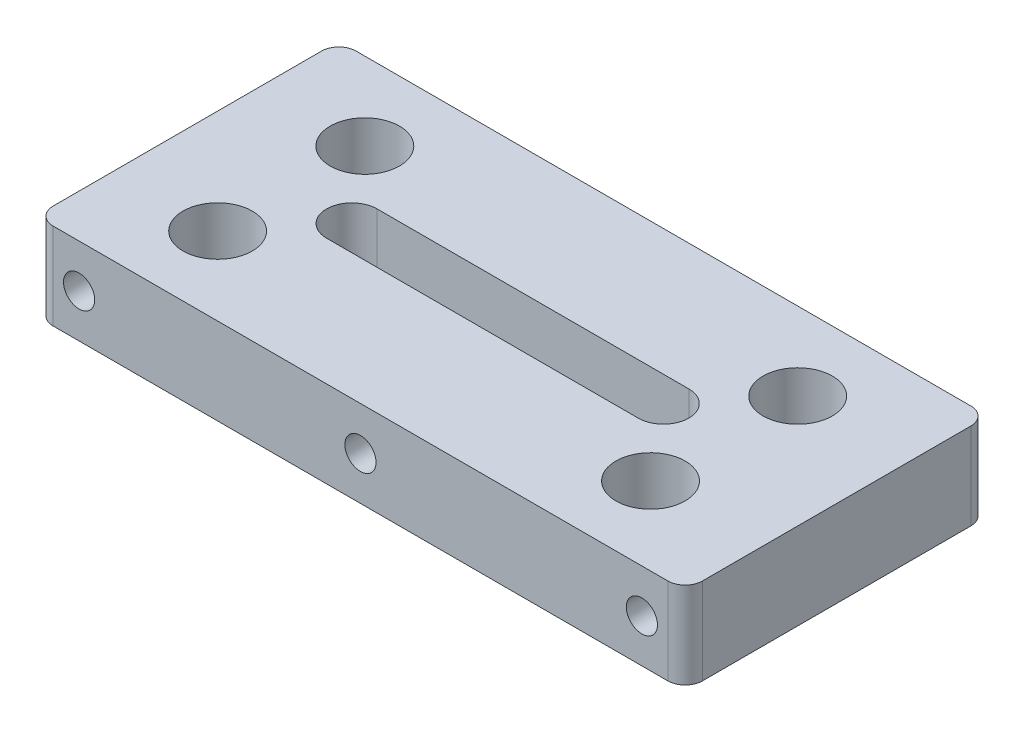
ISO-10303-21;
HEADER;
FILE_DESCRIPTION(('STEP AP214'),'2;1');
FILE_NAME('part.step','',(''),(''),'','','');
FILE_SCHEMA(('AUTOMOTIVE_DESIGN { 1 0 10303 214 1 1 1 1 }'));
ENDSEC;
DATA;
#1=APPLICATION_CONTEXT('core data for automotive mechanical design processes');
#2=APPLICATION_PROTOCOL_DEFINITION('international standard','automotive_design',2000,#1);
#3=PRODUCT_CONTEXT('',#1,'mechanical');
#4=PRODUCT('Part','Part','',(#3));
#5=PRODUCT_RELATED_PRODUCT_CATEGORY('part','',(#4));
#6=PRODUCT_DEFINITION_FORMATION('','',#4);
#7=PRODUCT_DEFINITION_CONTEXT('part definition',#1,'design');
#8=PRODUCT_DEFINITION('design','',#6,#7);
#9=PRODUCT_DEFINITION_SHAPE('','',#8);
#10=(LENGTH_UNIT() NAMED_UNIT(*) SI_UNIT(.MILLI.,.METRE.));
#11=(NAMED_UNIT(*) PLANE_ANGLE_UNIT() SI_UNIT($,.RADIAN.));
#12=(NAMED_UNIT(*) SI_UNIT($,.STERADIAN.) SOLID_ANGLE_UNIT());
#13=UNCERTAINTY_MEASURE_WITH_UNIT(LENGTH_MEASURE(1.E-05),#10,'distance_accuracy_value','');
#14=(GEOMETRIC_REPRESENTATION_CONTEXT(3) GLOBAL_UNCERTAINTY_ASSIGNED_CONTEXT((#13)) GLOBAL_UNIT_ASSIGNED_CONTEXT((#10,
#11,#12)) REPRESENTATION_CONTEXT('',''));
#15=CARTESIAN_POINT('',(0.,0.,0.));
#16=DIRECTION('',(0.,0.,1.));
#17=DIRECTION('',(1.,0.,0.));
#18=AXIS2_PLACEMENT_3D('',#15,#16,#17);
#19=CARTESIAN_POINT('',(0.,10.,0.));
#20=DIRECTION('',(1.,0.,0.));
#21=DIRECTION('',(0.,0.,-1.));
#22=AXIS2_PLACEMENT_3D('',#19,#20,#21);
#23=PLANE('',#22);
#24=DIRECTION('',(0.,0.,1.));
#25=VECTOR('',#24,1.);
#26=CARTESIAN_POINT('',(0.,10.,0.));
#27=LINE('',#26,#25);
#28=CARTESIAN_POINT('',(0.,10.,-33.));
#29=VERTEX_POINT('',#28);
#30=CARTESIAN_POINT('',(0.,10.,-2.));
#31=VERTEX_POINT('',#30);
#32=EDGE_CURVE('E248',#29,#31,#27,.T.);
#33=ORIENTED_EDGE('',*,*,#32,.F.);
#34=DIRECTION('',(0.,-1.,0.));
#35=VECTOR('',#34,1.);
#36=CARTESIAN_POINT('',(0.,10.,-33.));
#37=LINE('',#36,#35);
#38=CARTESIAN_POINT('',(0.,0.,-33.));
#39=VERTEX_POINT('',#38);
#40=EDGE_CURVE('E279',#29,#39,#37,.T.);
#41=ORIENTED_EDGE('',*,*,#40,.T.);
#42=DIRECTION('',(0.,0.,1.));
#43=VECTOR('',#42,1.);
#44=CARTESIAN_POINT('',(0.,0.,0.));
#45=LINE('',#44,#43);
#46=CARTESIAN_POINT('',(0.,0.,-2.));
#47=VERTEX_POINT('',#46);
#48=EDGE_CURVE('E228',#39,#47,#45,.T.);
#49=ORIENTED_EDGE('',*,*,#48,.T.);
#50=DIRECTION('',(0.,-1.,0.));
#51=VECTOR('',#50,1.);
#52=CARTESIAN_POINT('',(0.,10.,-2.));
#53=LINE('',#52,#51);
#54=EDGE_CURVE('E263',#47,#31,#53,.F.);
#55=ORIENTED_EDGE('',*,*,#54,.T.);
#56=EDGE_LOOP('',(#33,#41,#49,#55));
#57=FACE_BOUND('',#56,.T.);
#58=ADVANCED_FACE('F41',(#57),#23,.F.);
#59=CARTESIAN_POINT('',(0.,10.,0.));
#60=DIRECTION('',(0.,0.,-1.));
#61=DIRECTION('',(-1.,0.,0.));
#62=AXIS2_PLACEMENT_3D('',#59,#60,#61);
#63=PLANE('',#62);
#64=CARTESIAN_POINT('',(5.,5.,0.));
#65=DIRECTION('',(0.,0.,1.));
#66=DIRECTION('',(1.,0.,0.));
#67=AXIS2_PLACEMENT_3D('',#64,#65,#66);
#68=CIRCLE('',#67,1.8);
#69=CARTESIAN_POINT('',(6.8,5.,0.));
#70=VERTEX_POINT('',#69);
#71=EDGE_CURVE('E229',#70,#70,#68,.T.);
#72=ORIENTED_EDGE('',*,*,#71,.F.);
#73=EDGE_LOOP('',(#72));
#74=FACE_BOUND('',#73,.T.);
#75=CARTESIAN_POINT('',(37.5,5.,0.));
#76=DIRECTION('',(0.,0.,1.));
#77=DIRECTION('',(1.,0.,0.));
#78=AXIS2_PLACEMENT_3D('',#75,#76,#77);
#79=CIRCLE('',#78,1.8);
#80=CARTESIAN_POINT('',(39.3,5.,0.));
#81=VERTEX_POINT('',#80);
#82=EDGE_CURVE('E237',#81,#81,#79,.T.);
#83=ORIENTED_EDGE('',*,*,#82,.F.);
#84=EDGE_LOOP('',(#83));
#85=FACE_BOUND('',#84,.T.);
#86=CARTESIAN_POINT('',(70.,5.,0.));
#87=DIRECTION('',(0.,0.,1.));
#88=DIRECTION('',(1.,0.,0.));
#89=AXIS2_PLACEMENT_3D('',#86,#87,#88);
#90=CIRCLE('',#89,1.79999999999999);
#91=CARTESIAN_POINT('',(71.8,5.,0.));
#92=VERTEX_POINT('',#91);
#93=EDGE_CURVE('E204',#92,#92,#90,.T.);
#94=ORIENTED_EDGE('',*,*,#93,.F.);
#95=EDGE_LOOP('',(#94));
#96=FACE_BOUND('',#95,.T.);
#97=DIRECTION('',(1.,0.,0.));
#98=VECTOR('',#97,1.);
#99=CARTESIAN_POINT('',(0.,10.,0.));
#100=LINE('',#99,#98);
#101=CARTESIAN_POINT('',(2.,10.,0.));
#102=VERTEX_POINT('',#101);
#103=CARTESIAN_POINT('',(73.,10.,0.));
#104=VERTEX_POINT('',#103);
#105=EDGE_CURVE('E252',#102,#104,#100,.T.);
#106=ORIENTED_EDGE('',*,*,#105,.F.);
#107=DIRECTION('',(0.,-1.,0.));
#108=VECTOR('',#107,1.);
#109=CARTESIAN_POINT('',(2.,10.,0.));
#110=LINE('',#109,#108);
#111=CARTESIAN_POINT('',(2.,0.,0.));
#112=VERTEX_POINT('',#111);
#113=EDGE_CURVE('E316',#102,#112,#110,.T.);
#114=ORIENTED_EDGE('',*,*,#113,.T.);
#115=DIRECTION('',(1.,0.,0.));
#116=VECTOR('',#115,1.);
#117=CARTESIAN_POINT('',(0.,0.,0.));
#118=LINE('',#117,#116);
#119=CARTESIAN_POINT('',(73.,0.,0.));
#120=VERTEX_POINT('',#119);
#121=EDGE_CURVE('E267',#112,#120,#118,.T.);
#122=ORIENTED_EDGE('',*,*,#121,.T.);
#123=DIRECTION('',(0.,-1.,0.));
#124=VECTOR('',#123,1.);
#125=CARTESIAN_POINT('',(73.,10.,0.));
#126=LINE('',#125,#124);
#127=EDGE_CURVE('E313',#120,#104,#126,.F.);
#128=ORIENTED_EDGE('',*,*,#127,.T.);
#129=EDGE_LOOP('',(#106,#114,#122,#128));
#130=FACE_BOUND('',#129,.T.);
#131=ADVANCED_FACE('F369',(#74,#85,#96,#130),#63,.F.);
#132=CARTESIAN_POINT('',(75.,10.,0.));
#133=DIRECTION('',(-1.,0.,0.));
#134=DIRECTION('',(0.,0.,1.));
#135=AXIS2_PLACEMENT_3D('',#132,#133,#134);
#136=PLANE('',#135);
#137=DIRECTION('',(0.,0.,-1.));
#138=VECTOR('',#137,1.);
#139=CARTESIAN_POINT('',(75.,10.,0.));
#140=LINE('',#139,#138);
#141=CARTESIAN_POINT('',(75.,10.,-2.));
#142=VERTEX_POINT('',#141);
#143=CARTESIAN_POINT('',(75.,10.,-33.));
#144=VERTEX_POINT('',#143);
#145=EDGE_CURVE('E256',#142,#144,#140,.T.);
#146=ORIENTED_EDGE('',*,*,#145,.F.);
#147=DIRECTION('',(0.,-1.,0.));
#148=VECTOR('',#147,1.);
#149=CARTESIAN_POINT('',(75.,10.,-2.));
#150=LINE('',#149,#148);
#151=CARTESIAN_POINT('',(75.,0.,-2.));
#152=VERTEX_POINT('',#151);
#153=EDGE_CURVE('E11',#142,#152,#150,.T.);
#154=ORIENTED_EDGE('',*,*,#153,.T.);
#155=DIRECTION('',(0.,0.,-1.));
#156=VECTOR('',#155,1.);
#157=CARTESIAN_POINT('',(75.,0.,0.));
#158=LINE('',#157,#156);
#159=CARTESIAN_POINT('',(75.,0.,-33.));
#160=VERTEX_POINT('',#159);
#161=EDGE_CURVE('E271',#152,#160,#158,.T.);
#162=ORIENTED_EDGE('',*,*,#161,.T.);
#163=DIRECTION('',(0.,-1.,0.));
#164=VECTOR('',#163,1.);
#165=CARTESIAN_POINT('',(75.,10.,-33.));
#166=LINE('',#165,#164);
#167=EDGE_CURVE('E50',#160,#144,#166,.F.);
#168=ORIENTED_EDGE('',*,*,#167,.T.);
#169=EDGE_LOOP('',(#146,#154,#162,#168));
#170=FACE_BOUND('',#169,.T.);
#171=ADVANCED_FACE('F375',(#170),#136,.F.);
#172=CARTESIAN_POINT('',(0.,10.,-35.));
#173=DIRECTION('',(0.,0.,1.));
#174=DIRECTION('',(1.,0.,0.));
#175=AXIS2_PLACEMENT_3D('',#172,#173,#174);
#176=PLANE('',#175);
#177=CARTESIAN_POINT('',(5.,5.,-35.));
#178=DIRECTION('',(0.,0.,-1.));
#179=DIRECTION('',(-1.,0.,0.));
#180=AXIS2_PLACEMENT_3D('',#177,#178,#179);
#181=CIRCLE('',#180,1.8);
#182=CARTESIAN_POINT('',(3.2,5.,-35.));
#183=VERTEX_POINT('',#182);
#184=EDGE_CURVE('E205',#183,#183,#181,.T.);
#185=ORIENTED_EDGE('',*,*,#184,.F.);
#186=EDGE_LOOP('',(#185));
#187=FACE_BOUND('',#186,.T.);
#188=CARTESIAN_POINT('',(37.5,4.99999999999977,-35.));
#189=DIRECTION('',(0.,0.,-1.));
#190=DIRECTION('',(-1.,0.,0.));
#191=AXIS2_PLACEMENT_3D('',#188,#189,#190);
#192=CIRCLE('',#191,1.8);
#193=CARTESIAN_POINT('',(35.7,4.99999999999977,-35.));
#194=VERTEX_POINT('',#193);
#195=EDGE_CURVE('E213',#194,#194,#192,.T.);
#196=ORIENTED_EDGE('',*,*,#195,.F.);
#197=EDGE_LOOP('',(#196));
#198=FACE_BOUND('',#197,.T.);
#199=CARTESIAN_POINT('',(70.,4.99999999999955,-35.));
#200=DIRECTION('',(0.,0.,-1.));
#201=DIRECTION('',(-1.,0.,0.));
#202=AXIS2_PLACEMENT_3D('',#199,#200,#201);
#203=CIRCLE('',#202,1.79999999999999);
#204=CARTESIAN_POINT('',(68.2,4.99999999999955,-35.));
#205=VERTEX_POINT('',#204);
#206=EDGE_CURVE('E194',#205,#205,#203,.T.);
#207=ORIENTED_EDGE('',*,*,#206,.F.);
#208=EDGE_LOOP('',(#207));
#209=FACE_BOUND('',#208,.T.);
#210=DIRECTION('',(-1.,0.,0.));
#211=VECTOR('',#210,1.);
#212=CARTESIAN_POINT('',(0.,0.,-35.));
#213=LINE('',#212,#211);
#214=CARTESIAN_POINT('',(73.,0.,-35.));
#215=VERTEX_POINT('',#214);
#216=CARTESIAN_POINT('',(2.,0.,-35.));
#217=VERTEX_POINT('',#216);
#218=EDGE_CURVE('E253',#215,#217,#213,.T.);
#219=ORIENTED_EDGE('',*,*,#218,.T.);
#220=DIRECTION('',(0.,-1.,0.));
#221=VECTOR('',#220,1.);
#222=CARTESIAN_POINT('',(2.,10.,-35.));
#223=LINE('',#222,#221);
#224=CARTESIAN_POINT('',(2.,10.,-35.));
#225=VERTEX_POINT('',#224);
#226=EDGE_CURVE('E299',#217,#225,#223,.F.);
#227=ORIENTED_EDGE('',*,*,#226,.T.);
#228=DIRECTION('',(-1.,0.,0.));
#229=VECTOR('',#228,1.);
#230=CARTESIAN_POINT('',(0.,10.,-35.));
#231=LINE('',#230,#229);
#232=CARTESIAN_POINT('',(73.,10.,-35.));
#233=VERTEX_POINT('',#232);
#234=EDGE_CURVE('E259',#233,#225,#231,.T.);
#235=ORIENTED_EDGE('',*,*,#234,.F.);
#236=DIRECTION('',(0.,-1.,0.));
#237=VECTOR('',#236,1.);
#238=CARTESIAN_POINT('',(73.,10.,-35.));
#239=LINE('',#238,#237);
#240=EDGE_CURVE('E295',#233,#215,#239,.T.);
#241=ORIENTED_EDGE('',*,*,#240,.T.);
#242=EDGE_LOOP('',(#219,#227,#235,#241));
#243=FACE_BOUND('',#242,.T.);
#244=ADVANCED_FACE('F381',(#187,#198,#209,#243),#176,.F.);
#245=CARTESIAN_POINT('',(0.,10.,0.));
#246=DIRECTION('',(0.,-1.,0.));
#247=DIRECTION('',(0.,0.,-1.));
#248=AXIS2_PLACEMENT_3D('',#245,#246,#247);
#249=PLANE('',#248);
#250=DIRECTION('',(-1.,0.,0.));
#251=VECTOR('',#250,1.);
#252=CARTESIAN_POINT('',(19.,10.,-14.5767079941064));
#253=LINE('',#252,#251);
#254=CARTESIAN_POINT('',(55.,10.,-14.5767079941064));
#255=VERTEX_POINT('',#254);
#256=CARTESIAN_POINT('',(19.,10.,-14.5767079941064));
#257=VERTEX_POINT('',#256);
#258=EDGE_CURVE('E145',#255,#257,#253,.T.);
#259=ORIENTED_EDGE('',*,*,#258,.T.);
#260=CARTESIAN_POINT('',(19.,10.,-17.5));
#261=DIRECTION('',(0.,-1.,0.));
#262=DIRECTION('',(0.,0.,-1.));
#263=AXIS2_PLACEMENT_3D('',#260,#261,#262);
#264=CIRCLE('',#263,2.92329200589361);
#265=CARTESIAN_POINT('',(19.,10.,-20.4232920058936));
#266=VERTEX_POINT('',#265);
#267=EDGE_CURVE('E136',#257,#266,#264,.T.);
#268=ORIENTED_EDGE('',*,*,#267,.T.);
#269=DIRECTION('',(1.,0.,0.));
#270=VECTOR('',#269,1.);
#271=CARTESIAN_POINT('',(19.,10.,-20.4232920058936));
#272=LINE('',#271,#270);
#273=CARTESIAN_POINT('',(55.,10.,-20.4232920058936));
#274=VERTEX_POINT('',#273);
#275=EDGE_CURVE('E149',#266,#274,#272,.T.);
#276=ORIENTED_EDGE('',*,*,#275,.T.);
#277=CARTESIAN_POINT('',(55.,10.,-17.5));
#278=DIRECTION('',(0.,-1.,0.));
#279=DIRECTION('',(0.,0.,-1.));
#280=AXIS2_PLACEMENT_3D('',#277,#278,#279);
#281=CIRCLE('',#280,2.92329200589361);
#282=EDGE_CURVE('E154',#274,#255,#281,.T.);
#283=ORIENTED_EDGE('',*,*,#282,.T.);
#284=EDGE_LOOP('',(#259,#268,#276,#283));
#285=FACE_BOUND('',#284,.T.);
#286=CARTESIAN_POINT('',(12.,10.,-26.));
#287=DIRECTION('',(0.,-1.,0.));
#288=DIRECTION('',(0.,0.,1.));
#289=AXIS2_PLACEMENT_3D('',#286,#287,#288);
#290=CIRCLE('',#289,4.);
#291=CARTESIAN_POINT('',(12.,10.,-22.));
#292=VERTEX_POINT('',#291);
#293=EDGE_CURVE('E335',#292,#292,#290,.T.);
#294=ORIENTED_EDGE('',*,*,#293,.T.);
#295=EDGE_LOOP('',(#294));
#296=FACE_BOUND('',#295,.T.);
#297=CARTESIAN_POINT('',(62.,10.,-26.));
#298=DIRECTION('',(0.,-1.,0.));
#299=DIRECTION('',(0.,0.,1.));
#300=AXIS2_PLACEMENT_3D('',#297,#298,#299);
#301=CIRCLE('',#300,4.00000000000001);
#302=CARTESIAN_POINT('',(62.,10.,-22.));
#303=VERTEX_POINT('',#302);
#304=EDGE_CURVE('E327',#303,#303,#301,.T.);
#305=ORIENTED_EDGE('',*,*,#304,.T.);
#306=EDGE_LOOP('',(#305));
#307=FACE_BOUND('',#306,.T.);
#308=CARTESIAN_POINT('',(62.,10.,-9.));
#309=DIRECTION('',(0.,-1.,0.));
#310=DIRECTION('',(0.,0.,-1.));
#311=AXIS2_PLACEMENT_3D('',#308,#309,#310);
#312=CIRCLE('',#311,4.00000000000001);
#313=CARTESIAN_POINT('',(62.,10.,-13.));
#314=VERTEX_POINT('',#313);
#315=EDGE_CURVE('E199',#314,#314,#312,.T.);
#316=ORIENTED_EDGE('',*,*,#315,.T.);
#317=EDGE_LOOP('',(#316));
#318=FACE_BOUND('',#317,.T.);
#319=CARTESIAN_POINT('',(12.,10.,-9.));
#320=DIRECTION('',(0.,-1.,0.));
#321=DIRECTION('',(0.,0.,-1.));
#322=AXIS2_PLACEMENT_3D('',#319,#320,#321);
#323=CIRCLE('',#322,4.);
#324=CARTESIAN_POINT('',(12.,10.,-13.));
#325=VERTEX_POINT('',#324);
#326=EDGE_CURVE('E190',#325,#325,#323,.T.);
#327=ORIENTED_EDGE('',*,*,#326,.T.);
#328=EDGE_LOOP('',(#327));
#329=FACE_BOUND('',#328,.T.);
#330=ORIENTED_EDGE('',*,*,#234,.T.);
#331=CARTESIAN_POINT('',(2.,10.,-33.));
#332=DIRECTION('',(0.,-1.,0.));
#333=DIRECTION('',(0.,0.,-1.));
#334=AXIS2_PLACEMENT_3D('',#331,#332,#333);
#335=CIRCLE('',#334,2.);
#336=EDGE_CURVE('E310',#225,#29,#335,.F.);
#337=ORIENTED_EDGE('',*,*,#336,.T.);
#338=ORIENTED_EDGE('',*,*,#32,.T.);
#339=CARTESIAN_POINT('',(2.,10.,-2.));
#340=DIRECTION('',(0.,-1.,0.));
#341=DIRECTION('',(0.,0.,-1.));
#342=AXIS2_PLACEMENT_3D('',#339,#340,#341);
#343=CIRCLE('',#342,2.);
#344=EDGE_CURVE('E307',#31,#102,#343,.F.);
#345=ORIENTED_EDGE('',*,*,#344,.T.);
#346=ORIENTED_EDGE('',*,*,#105,.T.);
#347=CARTESIAN_POINT('',(73.,10.,-2.));
#348=DIRECTION('',(0.,-1.,0.));
#349=DIRECTION('',(0.,0.,-1.));
#350=AXIS2_PLACEMENT_3D('',#347,#348,#349);
#351=CIRCLE('',#350,2.);
#352=EDGE_CURVE('E63',#104,#142,#351,.F.);
#353=ORIENTED_EDGE('',*,*,#352,.T.);
#354=ORIENTED_EDGE('',*,*,#145,.T.);
#355=CARTESIAN_POINT('',(73.,10.,-33.));
#356=DIRECTION('',(0.,-1.,0.));
#357=DIRECTION('',(0.,0.,-1.));
#358=AXIS2_PLACEMENT_3D('',#355,#356,#357);
#359=CIRCLE('',#358,2.);
#360=EDGE_CURVE('E302',#144,#233,#359,.F.);
#361=ORIENTED_EDGE('',*,*,#360,.T.);
#362=EDGE_LOOP('',(#330,#337,#338,#345,#346,#353,#354,#361));
#363=FACE_BOUND('',#362,.T.);
#364=ADVANCED_FACE('F156',(#285,#296,#307,#318,#329,#363),#249,.F.);
#365=CARTESIAN_POINT('',(0.,0.,0.));
#366=DIRECTION('',(0.,-1.,0.));
#367=DIRECTION('',(0.,0.,-1.));
#368=AXIS2_PLACEMENT_3D('',#365,#366,#367);
#369=PLANE('',#368);
#370=CARTESIAN_POINT('',(19.,0.,-17.5));
#371=DIRECTION('',(0.,-1.,0.));
#372=DIRECTION('',(0.,0.,-1.));
#373=AXIS2_PLACEMENT_3D('',#370,#371,#372);
#374=CIRCLE('',#373,2.92329200589361);
#375=CARTESIAN_POINT('',(19.,0.,-14.5767079941064));
#376=VERTEX_POINT('',#375);
#377=CARTESIAN_POINT('',(19.,0.,-20.4232920058936));
#378=VERTEX_POINT('',#377);
#379=EDGE_CURVE('E139',#376,#378,#374,.T.);
#380=ORIENTED_EDGE('',*,*,#379,.F.);
#381=DIRECTION('',(-1.,0.,0.));
#382=VECTOR('',#381,1.);
#383=CARTESIAN_POINT('',(19.,0.,-14.5767079941064));
#384=LINE('',#383,#382);
#385=CARTESIAN_POINT('',(55.,0.,-14.5767079941064));
#386=VERTEX_POINT('',#385);
#387=EDGE_CURVE('E160',#386,#376,#384,.T.);
#388=ORIENTED_EDGE('',*,*,#387,.F.);
#389=CARTESIAN_POINT('',(55.,0.,-17.5));
#390=DIRECTION('',(0.,-1.,0.));
#391=DIRECTION('',(0.,0.,-1.));
#392=AXIS2_PLACEMENT_3D('',#389,#390,#391);
#393=CIRCLE('',#392,2.92329200589361);
#394=CARTESIAN_POINT('',(55.,0.,-20.4232920058936));
#395=VERTEX_POINT('',#394);
#396=EDGE_CURVE('E164',#395,#386,#393,.T.);
#397=ORIENTED_EDGE('',*,*,#396,.F.);
#398=DIRECTION('',(1.,0.,0.));
#399=VECTOR('',#398,1.);
#400=CARTESIAN_POINT('',(19.,0.,-20.4232920058936));
#401=LINE('',#400,#399);
#402=EDGE_CURVE('E176',#378,#395,#401,.T.);
#403=ORIENTED_EDGE('',*,*,#402,.F.);
#404=EDGE_LOOP('',(#380,#388,#397,#403));
#405=FACE_BOUND('',#404,.T.);
#406=CARTESIAN_POINT('',(12.,0.,-26.));
#407=DIRECTION('',(0.,-1.,0.));
#408=DIRECTION('',(0.,0.,1.));
#409=AXIS2_PLACEMENT_3D('',#406,#407,#408);
#410=CIRCLE('',#409,4.);
#411=CARTESIAN_POINT('',(12.,0.,-22.));
#412=VERTEX_POINT('',#411);
#413=EDGE_CURVE('E167',#412,#412,#410,.T.);
#414=ORIENTED_EDGE('',*,*,#413,.F.);
#415=EDGE_LOOP('',(#414));
#416=FACE_BOUND('',#415,.T.);
#417=CARTESIAN_POINT('',(62.,0.,-26.));
#418=DIRECTION('',(0.,-1.,0.));
#419=DIRECTION('',(0.,0.,1.));
#420=AXIS2_PLACEMENT_3D('',#417,#418,#419);
#421=CIRCLE('',#420,4.00000000000001);
#422=CARTESIAN_POINT('',(62.,0.,-22.));
#423=VERTEX_POINT('',#422);
#424=EDGE_CURVE('E331',#423,#423,#421,.T.);
#425=ORIENTED_EDGE('',*,*,#424,.F.);
#426=EDGE_LOOP('',(#425));
#427=FACE_BOUND('',#426,.T.);
#428=CARTESIAN_POINT('',(62.,0.,-9.));
#429=DIRECTION('',(0.,-1.,0.));
#430=DIRECTION('',(0.,0.,-1.));
#431=AXIS2_PLACEMENT_3D('',#428,#429,#430);
#432=CIRCLE('',#431,4.00000000000001);
#433=CARTESIAN_POINT('',(62.,0.,-13.));
#434=VERTEX_POINT('',#433);
#435=EDGE_CURVE('E323',#434,#434,#432,.T.);
#436=ORIENTED_EDGE('',*,*,#435,.F.);
#437=EDGE_LOOP('',(#436));
#438=FACE_BOUND('',#437,.T.);
#439=CARTESIAN_POINT('',(12.,0.,-9.));
#440=DIRECTION('',(0.,-1.,0.));
#441=DIRECTION('',(0.,0.,-1.));
#442=AXIS2_PLACEMENT_3D('',#439,#440,#441);
#443=CIRCLE('',#442,4.);
#444=CARTESIAN_POINT('',(12.,0.,-13.));
#445=VERTEX_POINT('',#444);
#446=EDGE_CURVE('E195',#445,#445,#443,.T.);
#447=ORIENTED_EDGE('',*,*,#446,.F.);
#448=EDGE_LOOP('',(#447));
#449=FACE_BOUND('',#448,.T.);
#450=ORIENTED_EDGE('',*,*,#48,.F.);
#451=CARTESIAN_POINT('',(2.,0.,-33.));
#452=DIRECTION('',(0.,-1.,0.));
#453=DIRECTION('',(0.,0.,-1.));
#454=AXIS2_PLACEMENT_3D('',#451,#452,#453);
#455=CIRCLE('',#454,2.);
#456=EDGE_CURVE('E292',#39,#217,#455,.T.);
#457=ORIENTED_EDGE('',*,*,#456,.T.);
#458=ORIENTED_EDGE('',*,*,#218,.F.);
#459=CARTESIAN_POINT('',(73.,0.,-33.));
#460=DIRECTION('',(0.,-1.,0.));
#461=DIRECTION('',(0.,0.,-1.));
#462=AXIS2_PLACEMENT_3D('',#459,#460,#461);
#463=CIRCLE('',#462,2.);
#464=EDGE_CURVE('E283',#215,#160,#463,.T.);
#465=ORIENTED_EDGE('',*,*,#464,.T.);
#466=ORIENTED_EDGE('',*,*,#161,.F.);
#467=CARTESIAN_POINT('',(73.,0.,-2.));
#468=DIRECTION('',(0.,-1.,0.));
#469=DIRECTION('',(0.,0.,-1.));
#470=AXIS2_PLACEMENT_3D('',#467,#468,#469);
#471=CIRCLE('',#470,2.);
#472=EDGE_CURVE('E286',#152,#120,#471,.T.);
#473=ORIENTED_EDGE('',*,*,#472,.T.);
#474=ORIENTED_EDGE('',*,*,#121,.F.);
#475=CARTESIAN_POINT('',(2.,0.,-2.));
#476=DIRECTION('',(0.,-1.,0.));
#477=DIRECTION('',(0.,0.,-1.));
#478=AXIS2_PLACEMENT_3D('',#475,#476,#477);
#479=CIRCLE('',#478,2.);
#480=EDGE_CURVE('E289',#112,#47,#479,.T.);
#481=ORIENTED_EDGE('',*,*,#480,.T.);
#482=EDGE_LOOP('',(#450,#457,#458,#465,#466,#473,#474,#481));
#483=FACE_BOUND('',#482,.T.);
#484=ADVANCED_FACE('F344',(#405,#416,#427,#438,#449,#483),#369,.T.);
#485=CARTESIAN_POINT('',(70.,5.,-10.));
#486=DIRECTION('',(0.,0.,1.));
#487=DIRECTION('',(1.,0.,0.));
#488=AXIS2_PLACEMENT_3D('',#485,#486,#487);
#489=CYLINDRICAL_SURFACE('',#488,1.79999999999999);
#490=CARTESIAN_POINT('',(70.,5.,-10.));
#491=DIRECTION('',(0.,0.,1.));
#492=DIRECTION('',(1.,0.,0.));
#493=AXIS2_PLACEMENT_3D('',#490,#491,#492);
#494=CIRCLE('',#493,1.79999999999999);
#495=CARTESIAN_POINT('',(71.8,5.,-10.));
#496=VERTEX_POINT('',#495);
#497=EDGE_CURVE('E241',#496,#496,#494,.T.);
#498=ORIENTED_EDGE('',*,*,#497,.F.);
#499=EDGE_LOOP('',(#498));
#500=FACE_BOUND('',#499,.T.);
#501=ORIENTED_EDGE('',*,*,#93,.T.);
#502=EDGE_LOOP('',(#501));
#503=FACE_BOUND('',#502,.T.);
#504=ADVANCED_FACE('F347',(#500,#503),#489,.F.);
#505=CARTESIAN_POINT('',(70.,5.,-10.));
#506=DIRECTION('',(0.,0.,1.));
#507=DIRECTION('',(1.,0.,0.));
#508=AXIS2_PLACEMENT_3D('',#505,#506,#507);
#509=PLANE('',#508);
#510=ORIENTED_EDGE('',*,*,#497,.T.);
#511=EDGE_LOOP('',(#510));
#512=FACE_BOUND('',#511,.T.);
#513=ADVANCED_FACE('F412',(#512),#509,.T.);
#514=CARTESIAN_POINT('',(37.5,5.,-10.));
#515=DIRECTION('',(0.,0.,1.));
#516=DIRECTION('',(1.,0.,0.));
#517=AXIS2_PLACEMENT_3D('',#514,#515,#516);
#518=CYLINDRICAL_SURFACE('',#517,1.8);
#519=CARTESIAN_POINT('',(37.5,5.,-10.));
#520=DIRECTION('',(0.,0.,1.));
#521=DIRECTION('',(1.,0.,0.));
#522=AXIS2_PLACEMENT_3D('',#519,#520,#521);
#523=CIRCLE('',#522,1.8);
#524=CARTESIAN_POINT('',(39.3,5.,-10.));
#525=VERTEX_POINT('',#524);
#526=EDGE_CURVE('E233',#525,#525,#523,.T.);
#527=ORIENTED_EDGE('',*,*,#526,.F.);
#528=EDGE_LOOP('',(#527));
#529=FACE_BOUND('',#528,.T.);
#530=ORIENTED_EDGE('',*,*,#82,.T.);
#531=EDGE_LOOP('',(#530));
#532=FACE_BOUND('',#531,.T.);
#533=ADVANCED_FACE('F416',(#529,#532),#518,.F.);
#534=CARTESIAN_POINT('',(37.5,5.,-10.));
#535=DIRECTION('',(0.,0.,1.));
#536=DIRECTION('',(1.,0.,0.));
#537=AXIS2_PLACEMENT_3D('',#534,#535,#536);
#538=PLANE('',#537);
#539=ORIENTED_EDGE('',*,*,#526,.T.);
#540=EDGE_LOOP('',(#539));
#541=FACE_BOUND('',#540,.T.);
#542=ADVANCED_FACE('F420',(#541),#538,.T.);
#543=CARTESIAN_POINT('',(5.,5.,-10.));
#544=DIRECTION('',(0.,0.,1.));
#545=DIRECTION('',(1.,0.,0.));
#546=AXIS2_PLACEMENT_3D('',#543,#544,#545);
#547=CYLINDRICAL_SURFACE('',#546,1.8);
#548=CARTESIAN_POINT('',(5.,5.,-10.));
#549=DIRECTION('',(0.,0.,1.));
#550=DIRECTION('',(1.,0.,0.));
#551=AXIS2_PLACEMENT_3D('',#548,#549,#550);
#552=CIRCLE('',#551,1.8);
#553=CARTESIAN_POINT('',(6.8,5.,-10.));
#554=VERTEX_POINT('',#553);
#555=EDGE_CURVE('E224',#554,#554,#552,.T.);
#556=ORIENTED_EDGE('',*,*,#555,.F.);
#557=EDGE_LOOP('',(#556));
#558=FACE_BOUND('',#557,.T.);
#559=ORIENTED_EDGE('',*,*,#71,.T.);
#560=EDGE_LOOP('',(#559));
#561=FACE_BOUND('',#560,.T.);
#562=ADVANCED_FACE('F424',(#558,#561),#547,.F.);
#563=CARTESIAN_POINT('',(5.,5.,-10.));
#564=DIRECTION('',(0.,0.,1.));
#565=DIRECTION('',(1.,0.,0.));
#566=AXIS2_PLACEMENT_3D('',#563,#564,#565);
#567=PLANE('',#566);
#568=ORIENTED_EDGE('',*,*,#555,.T.);
#569=EDGE_LOOP('',(#568));
#570=FACE_BOUND('',#569,.T.);
#571=ADVANCED_FACE('F428',(#570),#567,.T.);
#572=CARTESIAN_POINT('',(70.,4.99999999999955,-25.));
#573=DIRECTION('',(0.,0.,-1.));
#574=DIRECTION('',(-1.,0.,0.));
#575=AXIS2_PLACEMENT_3D('',#572,#573,#574);
#576=CYLINDRICAL_SURFACE('',#575,1.79999999999999);
#577=CARTESIAN_POINT('',(70.,4.99999999999955,-25.));
#578=DIRECTION('',(0.,0.,-1.));
#579=DIRECTION('',(-1.,0.,0.));
#580=AXIS2_PLACEMENT_3D('',#577,#578,#579);
#581=CIRCLE('',#580,1.79999999999999);
#582=CARTESIAN_POINT('',(68.2,4.99999999999955,-25.));
#583=VERTEX_POINT('',#582);
#584=EDGE_CURVE('E217',#583,#583,#581,.T.);
#585=ORIENTED_EDGE('',*,*,#584,.F.);
#586=EDGE_LOOP('',(#585));
#587=FACE_BOUND('',#586,.T.);
#588=ORIENTED_EDGE('',*,*,#206,.T.);
#589=EDGE_LOOP('',(#588));
#590=FACE_BOUND('',#589,.T.);
#591=ADVANCED_FACE('F432',(#587,#590),#576,.F.);
#592=CARTESIAN_POINT('',(70.,4.99999999999955,-25.));
#593=DIRECTION('',(0.,0.,-1.));
#594=DIRECTION('',(-1.,0.,0.));
#595=AXIS2_PLACEMENT_3D('',#592,#593,#594);
#596=PLANE('',#595);
#597=ORIENTED_EDGE('',*,*,#584,.T.);
#598=EDGE_LOOP('',(#597));
#599=FACE_BOUND('',#598,.T.);
#600=ADVANCED_FACE('F436',(#599),#596,.T.);
#601=CARTESIAN_POINT('',(37.5,4.99999999999977,-25.));
#602=DIRECTION('',(0.,0.,-1.));
#603=DIRECTION('',(-1.,0.,0.));
#604=AXIS2_PLACEMENT_3D('',#601,#602,#603);
#605=CYLINDRICAL_SURFACE('',#604,1.8);
#606=CARTESIAN_POINT('',(37.5,4.99999999999977,-25.));
#607=DIRECTION('',(0.,0.,-1.));
#608=DIRECTION('',(-1.,0.,0.));
#609=AXIS2_PLACEMENT_3D('',#606,#607,#608);
#610=CIRCLE('',#609,1.8);
#611=CARTESIAN_POINT('',(35.7,4.99999999999977,-25.));
#612=VERTEX_POINT('',#611);
#613=EDGE_CURVE('E209',#612,#612,#610,.T.);
#614=ORIENTED_EDGE('',*,*,#613,.F.);
#615=EDGE_LOOP('',(#614));
#616=FACE_BOUND('',#615,.T.);
#617=ORIENTED_EDGE('',*,*,#195,.T.);
#618=EDGE_LOOP('',(#617));
#619=FACE_BOUND('',#618,.T.);
#620=ADVANCED_FACE('F440',(#616,#619),#605,.F.);
#621=CARTESIAN_POINT('',(37.5,4.99999999999977,-25.));
#622=DIRECTION('',(0.,0.,-1.));
#623=DIRECTION('',(-1.,0.,0.));
#624=AXIS2_PLACEMENT_3D('',#621,#622,#623);
#625=PLANE('',#624);
#626=ORIENTED_EDGE('',*,*,#613,.T.);
#627=EDGE_LOOP('',(#626));
#628=FACE_BOUND('',#627,.T.);
#629=ADVANCED_FACE('F444',(#628),#625,.T.);
#630=CARTESIAN_POINT('',(5.,5.,-25.));
#631=DIRECTION('',(0.,0.,-1.));
#632=DIRECTION('',(-1.,0.,0.));
#633=AXIS2_PLACEMENT_3D('',#630,#631,#632);
#634=CYLINDRICAL_SURFACE('',#633,1.8);
#635=CARTESIAN_POINT('',(5.,5.,-25.));
#636=DIRECTION('',(0.,0.,-1.));
#637=DIRECTION('',(-1.,0.,0.));
#638=AXIS2_PLACEMENT_3D('',#635,#636,#637);
#639=CIRCLE('',#638,1.8);
#640=CARTESIAN_POINT('',(3.2,5.,-25.));
#641=VERTEX_POINT('',#640);
#642=EDGE_CURVE('E200',#641,#641,#639,.T.);
#643=ORIENTED_EDGE('',*,*,#642,.F.);
#644=EDGE_LOOP('',(#643));
#645=FACE_BOUND('',#644,.T.);
#646=ORIENTED_EDGE('',*,*,#184,.T.);
#647=EDGE_LOOP('',(#646));
#648=FACE_BOUND('',#647,.T.);
#649=ADVANCED_FACE('F448',(#645,#648),#634,.F.);
#650=CARTESIAN_POINT('',(5.,5.,-25.));
#651=DIRECTION('',(0.,0.,-1.));
#652=DIRECTION('',(-1.,0.,0.));
#653=AXIS2_PLACEMENT_3D('',#650,#651,#652);
#654=PLANE('',#653);
#655=ORIENTED_EDGE('',*,*,#642,.T.);
#656=EDGE_LOOP('',(#655));
#657=FACE_BOUND('',#656,.T.);
#658=ADVANCED_FACE('F452',(#657),#654,.T.);
#659=CARTESIAN_POINT('',(12.,10.,-9.));
#660=DIRECTION('',(0.,-1.,0.));
#661=DIRECTION('',(0.,0.,-1.));
#662=AXIS2_PLACEMENT_3D('',#659,#660,#661);
#663=CYLINDRICAL_SURFACE('',#662,4.);
#664=ORIENTED_EDGE('',*,*,#326,.F.);
#665=EDGE_LOOP('',(#664));
#666=FACE_BOUND('',#665,.T.);
#667=ORIENTED_EDGE('',*,*,#446,.T.);
#668=EDGE_LOOP('',(#667));
#669=FACE_BOUND('',#668,.T.);
#670=ADVANCED_FACE('F456',(#666,#669),#663,.F.);
#671=CARTESIAN_POINT('',(62.,10.,-9.));
#672=DIRECTION('',(0.,-1.,0.));
#673=DIRECTION('',(0.,0.,-1.));
#674=AXIS2_PLACEMENT_3D('',#671,#672,#673);
#675=CYLINDRICAL_SURFACE('',#674,4.00000000000001);
#676=ORIENTED_EDGE('',*,*,#315,.F.);
#677=EDGE_LOOP('',(#676));
#678=FACE_BOUND('',#677,.T.);
#679=ORIENTED_EDGE('',*,*,#435,.T.);
#680=EDGE_LOOP('',(#679));
#681=FACE_BOUND('',#680,.T.);
#682=ADVANCED_FACE('F460',(#678,#681),#675,.F.);
#683=CARTESIAN_POINT('',(62.,10.,-26.));
#684=DIRECTION('',(0.,-1.,0.));
#685=DIRECTION('',(0.,0.,-1.));
#686=AXIS2_PLACEMENT_3D('',#683,#684,#685);
#687=CYLINDRICAL_SURFACE('',#686,4.00000000000001);
#688=ORIENTED_EDGE('',*,*,#304,.F.);
#689=EDGE_LOOP('',(#688));
#690=FACE_BOUND('',#689,.T.);
#691=ORIENTED_EDGE('',*,*,#424,.T.);
#692=EDGE_LOOP('',(#691));
#693=FACE_BOUND('',#692,.T.);
#694=ADVANCED_FACE('F473',(#690,#693),#687,.F.);
#695=CARTESIAN_POINT('',(12.,10.,-26.));
#696=DIRECTION('',(0.,-1.,0.));
#697=DIRECTION('',(0.,0.,-1.));
#698=AXIS2_PLACEMENT_3D('',#695,#696,#697);
#699=CYLINDRICAL_SURFACE('',#698,4.);
#700=ORIENTED_EDGE('',*,*,#293,.F.);
#701=EDGE_LOOP('',(#700));
#702=FACE_BOUND('',#701,.T.);
#703=ORIENTED_EDGE('',*,*,#413,.T.);
#704=EDGE_LOOP('',(#703));
#705=FACE_BOUND('',#704,.T.);
#706=ADVANCED_FACE('F342',(#702,#705),#699,.F.);
#707=CARTESIAN_POINT('',(19.,10.,-17.5));
#708=DIRECTION('',(0.,-1.,0.));
#709=DIRECTION('',(0.,0.,-1.));
#710=AXIS2_PLACEMENT_3D('',#707,#708,#709);
#711=CYLINDRICAL_SURFACE('',#710,2.92329200589361);
#712=ORIENTED_EDGE('',*,*,#379,.T.);
#713=DIRECTION('',(0.,-1.,0.));
#714=VECTOR('',#713,1.);
#715=CARTESIAN_POINT('',(19.,10.,-20.4232920058936));
#716=LINE('',#715,#714);
#717=EDGE_CURVE('E132',#266,#378,#716,.T.);
#718=ORIENTED_EDGE('',*,*,#717,.F.);
#719=ORIENTED_EDGE('',*,*,#267,.F.);
#720=DIRECTION('',(0.,-1.,0.));
#721=VECTOR('',#720,1.);
#722=CARTESIAN_POINT('',(19.,10.,-14.5767079941064));
#723=LINE('',#722,#721);
#724=EDGE_CURVE('E182',#257,#376,#723,.T.);
#725=ORIENTED_EDGE('',*,*,#724,.T.);
#726=EDGE_LOOP('',(#712,#718,#719,#725));
#727=FACE_BOUND('',#726,.T.);
#728=ADVANCED_FACE('F134',(#727),#711,.F.);
#729=CARTESIAN_POINT('',(19.,10.,-14.5767079941064));
#730=DIRECTION('',(0.,0.,1.));
#731=DIRECTION('',(1.,0.,0.));
#732=AXIS2_PLACEMENT_3D('',#729,#730,#731);
#733=PLANE('',#732);
#734=ORIENTED_EDGE('',*,*,#387,.T.);
#735=ORIENTED_EDGE('',*,*,#724,.F.);
#736=ORIENTED_EDGE('',*,*,#258,.F.);
#737=DIRECTION('',(0.,-1.,0.));
#738=VECTOR('',#737,1.);
#739=CARTESIAN_POINT('',(55.,10.,-14.5767079941064));
#740=LINE('',#739,#738);
#741=EDGE_CURVE('E185',#255,#386,#740,.T.);
#742=ORIENTED_EDGE('',*,*,#741,.T.);
#743=EDGE_LOOP('',(#734,#735,#736,#742));
#744=FACE_BOUND('',#743,.T.);
#745=ADVANCED_FACE('F463',(#744),#733,.F.);
#746=CARTESIAN_POINT('',(55.,10.,-17.5));
#747=DIRECTION('',(0.,-1.,0.));
#748=DIRECTION('',(0.,0.,-1.));
#749=AXIS2_PLACEMENT_3D('',#746,#747,#748);
#750=CYLINDRICAL_SURFACE('',#749,2.92329200589361);
#751=ORIENTED_EDGE('',*,*,#396,.T.);
#752=ORIENTED_EDGE('',*,*,#741,.F.);
#753=ORIENTED_EDGE('',*,*,#282,.F.);
#754=DIRECTION('',(0.,-1.,0.));
#755=VECTOR('',#754,1.);
#756=CARTESIAN_POINT('',(55.,10.,-20.4232920058936));
#757=LINE('',#756,#755);
#758=EDGE_CURVE('E144',#274,#395,#757,.T.);
#759=ORIENTED_EDGE('',*,*,#758,.T.);
#760=EDGE_LOOP('',(#751,#752,#753,#759));
#761=FACE_BOUND('',#760,.T.);
#762=ADVANCED_FACE('F393',(#761),#750,.F.);
#763=CARTESIAN_POINT('',(19.,10.,-20.4232920058936));
#764=DIRECTION('',(0.,0.,-1.));
#765=DIRECTION('',(-1.,0.,0.));
#766=AXIS2_PLACEMENT_3D('',#763,#764,#765);
#767=PLANE('',#766);
#768=ORIENTED_EDGE('',*,*,#402,.T.);
#769=ORIENTED_EDGE('',*,*,#758,.F.);
#770=ORIENTED_EDGE('',*,*,#275,.F.);
#771=ORIENTED_EDGE('',*,*,#717,.T.);
#772=EDGE_LOOP('',(#768,#769,#770,#771));
#773=FACE_BOUND('',#772,.T.);
#774=ADVANCED_FACE('F150',(#773),#767,.F.);
#775=CARTESIAN_POINT('',(2.,10.,-33.));
#776=DIRECTION('',(0.,-1.,0.));
#777=DIRECTION('',(0.,0.,-1.));
#778=AXIS2_PLACEMENT_3D('',#775,#776,#777);
#779=CYLINDRICAL_SURFACE('',#778,2.);
#780=ORIENTED_EDGE('',*,*,#336,.F.);
#781=ORIENTED_EDGE('',*,*,#226,.F.);
#782=ORIENTED_EDGE('',*,*,#456,.F.);
#783=ORIENTED_EDGE('',*,*,#40,.F.);
#784=EDGE_LOOP('',(#780,#781,#782,#783));
#785=FACE_BOUND('',#784,.T.);
#786=ADVANCED_FACE('F385',(#785),#779,.T.);
#787=CARTESIAN_POINT('',(2.,10.,-2.));
#788=DIRECTION('',(0.,-1.,0.));
#789=DIRECTION('',(0.,0.,-1.));
#790=AXIS2_PLACEMENT_3D('',#787,#788,#789);
#791=CYLINDRICAL_SURFACE('',#790,2.);
#792=ORIENTED_EDGE('',*,*,#344,.F.);
#793=ORIENTED_EDGE('',*,*,#54,.F.);
#794=ORIENTED_EDGE('',*,*,#480,.F.);
#795=ORIENTED_EDGE('',*,*,#113,.F.);
#796=EDGE_LOOP('',(#792,#793,#794,#795));
#797=FACE_BOUND('',#796,.T.);
#798=ADVANCED_FACE('F365',(#797),#791,.T.);
#799=CARTESIAN_POINT('',(73.,10.,-2.));
#800=DIRECTION('',(0.,-1.,0.));
#801=DIRECTION('',(0.,0.,-1.));
#802=AXIS2_PLACEMENT_3D('',#799,#800,#801);
#803=CYLINDRICAL_SURFACE('',#802,2.);
#804=ORIENTED_EDGE('',*,*,#352,.F.);
#805=ORIENTED_EDGE('',*,*,#127,.F.);
#806=ORIENTED_EDGE('',*,*,#472,.F.);
#807=ORIENTED_EDGE('',*,*,#153,.F.);
#808=EDGE_LOOP('',(#804,#805,#806,#807));
#809=FACE_BOUND('',#808,.T.);
#810=ADVANCED_FACE('F372',(#809),#803,.T.);
#811=CARTESIAN_POINT('',(73.,10.,-33.));
#812=DIRECTION('',(0.,-1.,0.));
#813=DIRECTION('',(0.,0.,-1.));
#814=AXIS2_PLACEMENT_3D('',#811,#812,#813);
#815=CYLINDRICAL_SURFACE('',#814,2.);
#816=ORIENTED_EDGE('',*,*,#360,.F.);
#817=ORIENTED_EDGE('',*,*,#167,.F.);
#818=ORIENTED_EDGE('',*,*,#464,.F.);
#819=ORIENTED_EDGE('',*,*,#240,.F.);
#820=EDGE_LOOP('',(#816,#817,#818,#819));
#821=FACE_BOUND('',#820,.T.);
#822=ADVANCED_FACE('F43',(#821),#815,.T.);
#823=CLOSED_SHELL('',(#58,#131,#171,#244,#364,#484,#504,#513,#533,#542,#562,#571,#591,#600,#620,
#629,#649,#658,#670,#682,#694,#706,#728,#745,#762,#774,#786,#798,#810,#822));
#824=MANIFOLD_SOLID_BREP('B2',#823);
#825=ADVANCED_BREP_SHAPE_REPRESENTATION('',(#18,#824),#14);
#826=SHAPE_DEFINITION_REPRESENTATION(#9,#825);
ENDSEC;
END-ISO-10303-21;
